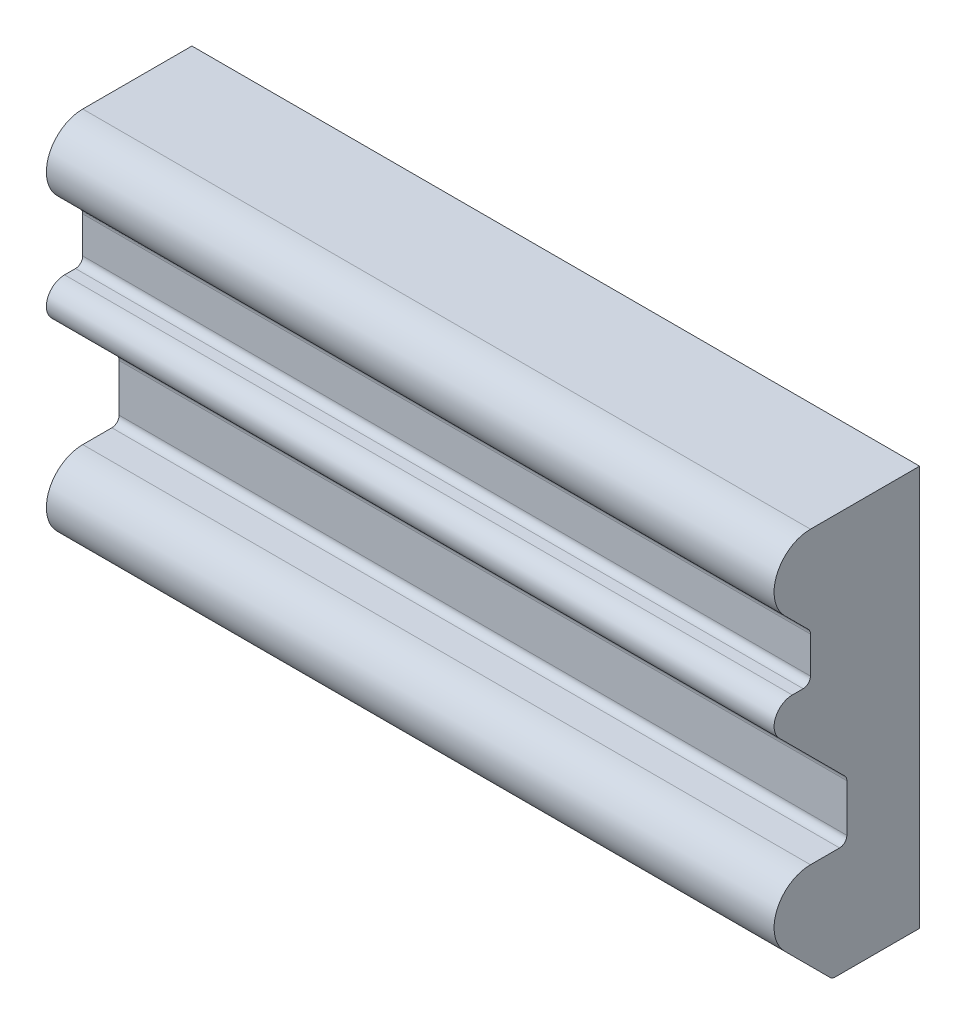
ISO-10303-21;
HEADER;
FILE_DESCRIPTION(('STEP AP214'),'2;1');
FILE_NAME('part.step','',(''),(''),'','','');
FILE_SCHEMA(('AUTOMOTIVE_DESIGN { 1 0 10303 214 1 1 1 1 }'));
ENDSEC;
DATA;
#1=APPLICATION_CONTEXT('core data for automotive mechanical design processes');
#2=APPLICATION_PROTOCOL_DEFINITION('international standard','automotive_design',2000,#1);
#3=PRODUCT_CONTEXT('',#1,'mechanical');
#4=PRODUCT('Part','Part','',(#3));
#5=PRODUCT_RELATED_PRODUCT_CATEGORY('part','',(#4));
#6=PRODUCT_DEFINITION_FORMATION('','',#4);
#7=PRODUCT_DEFINITION_CONTEXT('part definition',#1,'design');
#8=PRODUCT_DEFINITION('design','',#6,#7);
#9=PRODUCT_DEFINITION_SHAPE('','',#8);
#10=(LENGTH_UNIT() NAMED_UNIT(*) SI_UNIT(.MILLI.,.METRE.));
#11=(NAMED_UNIT(*) PLANE_ANGLE_UNIT() SI_UNIT($,.RADIAN.));
#12=(NAMED_UNIT(*) SI_UNIT($,.STERADIAN.) SOLID_ANGLE_UNIT());
#13=UNCERTAINTY_MEASURE_WITH_UNIT(LENGTH_MEASURE(1.E-05),#10,'distance_accuracy_value','');
#14=(GEOMETRIC_REPRESENTATION_CONTEXT(3) GLOBAL_UNCERTAINTY_ASSIGNED_CONTEXT((#13)) GLOBAL_UNIT_ASSIGNED_CONTEXT((#10,
#11,#12)) REPRESENTATION_CONTEXT('',''));
#15=CARTESIAN_POINT('',(0.,0.,0.));
#16=DIRECTION('',(0.,0.,1.));
#17=DIRECTION('',(1.,0.,0.));
#18=AXIS2_PLACEMENT_3D('',#15,#16,#17);
#19=CARTESIAN_POINT('',(200.,75.0294372515229,32.));
#20=DIRECTION('',(-1.,0.,0.));
#21=DIRECTION('',(0.,0.,1.));
#22=AXIS2_PLACEMENT_3D('',#19,#20,#21);
#23=CYLINDRICAL_SURFACE('',#22,2.);
#24=CARTESIAN_POINT('',(0.,75.0294372515229,32.));
#25=DIRECTION('',(-1.,0.,0.));
#26=DIRECTION('',(0.,0.,1.));
#27=AXIS2_PLACEMENT_3D('',#24,#25,#26);
#28=CIRCLE('',#27,2.);
#29=CARTESIAN_POINT('',(0.,75.0294372515229,30.));
#30=VERTEX_POINT('',#29);
#31=CARTESIAN_POINT('',(0.,73.0294372515229,32.));
#32=VERTEX_POINT('',#31);
#33=EDGE_CURVE('E188',#30,#32,#28,.T.);
#34=ORIENTED_EDGE('',*,*,#33,.T.);
#35=DIRECTION('',(-1.,0.,0.));
#36=VECTOR('',#35,1.);
#37=CARTESIAN_POINT('',(200.,73.0294372515229,32.));
#38=LINE('',#37,#36);
#39=CARTESIAN_POINT('',(200.,73.0294372515229,32.));
#40=VERTEX_POINT('',#39);
#41=EDGE_CURVE('E11',#40,#32,#38,.T.);
#42=ORIENTED_EDGE('',*,*,#41,.F.);
#43=CARTESIAN_POINT('',(200.,75.0294372515229,32.));
#44=DIRECTION('',(-1.,0.,0.));
#45=DIRECTION('',(0.,0.,1.));
#46=AXIS2_PLACEMENT_3D('',#43,#44,#45);
#47=CIRCLE('',#46,2.);
#48=CARTESIAN_POINT('',(200.,75.0294372515229,30.));
#49=VERTEX_POINT('',#48);
#50=EDGE_CURVE('E222',#49,#40,#47,.T.);
#51=ORIENTED_EDGE('',*,*,#50,.F.);
#52=DIRECTION('',(-1.,0.,0.));
#53=VECTOR('',#52,1.);
#54=CARTESIAN_POINT('',(200.,75.0294372515229,30.));
#55=LINE('',#54,#53);
#56=EDGE_CURVE('E184',#49,#30,#55,.T.);
#57=ORIENTED_EDGE('',*,*,#56,.T.);
#58=EDGE_LOOP('',(#34,#42,#51,#57));
#59=FACE_BOUND('',#58,.T.);
#60=ADVANCED_FACE('F32',(#59),#23,.F.);
#61=CARTESIAN_POINT('',(200.,73.0294372515229,35.));
#62=DIRECTION('',(0.,-1.,0.));
#63=DIRECTION('',(0.,0.,-1.));
#64=AXIS2_PLACEMENT_3D('',#61,#62,#63);
#65=PLANE('',#64);
#66=DIRECTION('',(0.,0.,1.));
#67=VECTOR('',#66,1.);
#68=CARTESIAN_POINT('',(0.,73.0294372515229,35.));
#69=LINE('',#68,#67);
#70=CARTESIAN_POINT('',(0.,73.0294372515229,35.));
#71=VERTEX_POINT('',#70);
#72=EDGE_CURVE('E191',#32,#71,#69,.T.);
#73=ORIENTED_EDGE('',*,*,#72,.T.);
#74=DIRECTION('',(-1.,0.,0.));
#75=VECTOR('',#74,1.);
#76=CARTESIAN_POINT('',(200.,73.0294372515229,35.));
#77=LINE('',#76,#75);
#78=CARTESIAN_POINT('',(200.,73.0294372515229,35.));
#79=VERTEX_POINT('',#78);
#80=EDGE_CURVE('E40',#79,#71,#77,.T.);
#81=ORIENTED_EDGE('',*,*,#80,.F.);
#82=DIRECTION('',(0.,0.,1.));
#83=VECTOR('',#82,1.);
#84=CARTESIAN_POINT('',(200.,73.0294372515229,35.));
#85=LINE('',#84,#83);
#86=EDGE_CURVE('E121',#40,#79,#85,.T.);
#87=ORIENTED_EDGE('',*,*,#86,.F.);
#88=ORIENTED_EDGE('',*,*,#41,.T.);
#89=EDGE_LOOP('',(#73,#81,#87,#88));
#90=FACE_BOUND('',#89,.T.);
#91=ADVANCED_FACE('F330',(#90),#65,.F.);
#92=CARTESIAN_POINT('',(200.,68.0294372515229,35.));
#93=DIRECTION('',(-1.,0.,0.));
#94=DIRECTION('',(0.,0.,1.));
#95=AXIS2_PLACEMENT_3D('',#92,#93,#94);
#96=CYLINDRICAL_SURFACE('',#95,5.);
#97=CARTESIAN_POINT('',(0.,68.0294372515229,35.));
#98=DIRECTION('',(1.,0.,0.));
#99=DIRECTION('',(0.,0.,-1.));
#100=AXIS2_PLACEMENT_3D('',#97,#98,#99);
#101=CIRCLE('',#100,5.);
#102=CARTESIAN_POINT('',(0.,64.4939033455902,38.5355339059328));
#103=VERTEX_POINT('',#102);
#104=EDGE_CURVE('E193',#71,#103,#101,.T.);
#105=ORIENTED_EDGE('',*,*,#104,.T.);
#106=DIRECTION('',(-1.,0.,0.));
#107=VECTOR('',#106,1.);
#108=CARTESIAN_POINT('',(200.,64.4939033455902,38.5355339059328));
#109=LINE('',#108,#107);
#110=CARTESIAN_POINT('',(200.,64.4939033455902,38.5355339059328));
#111=VERTEX_POINT('',#110);
#112=EDGE_CURVE('E259',#111,#103,#109,.T.);
#113=ORIENTED_EDGE('',*,*,#112,.F.);
#114=CARTESIAN_POINT('',(200.,68.0294372515229,35.));
#115=DIRECTION('',(1.,0.,0.));
#116=DIRECTION('',(0.,0.,-1.));
#117=AXIS2_PLACEMENT_3D('',#114,#115,#116);
#118=CIRCLE('',#117,5.);
#119=EDGE_CURVE('E267',#79,#111,#118,.T.);
#120=ORIENTED_EDGE('',*,*,#119,.F.);
#121=ORIENTED_EDGE('',*,*,#80,.T.);
#122=EDGE_LOOP('',(#105,#113,#120,#121));
#123=FACE_BOUND('',#122,.T.);
#124=ADVANCED_FACE('F265',(#123),#96,.T.);
#125=CARTESIAN_POINT('',(200.,64.4939033455902,38.5355339059328));
#126=DIRECTION('',(0.,0.707106781186544,-0.707106781186552));
#127=DIRECTION('',(0.,0.707106781186551,0.707106781186544));
#128=AXIS2_PLACEMENT_3D('',#125,#126,#127);
#129=PLANE('',#128);
#130=DIRECTION('',(0.,-0.707106781186551,-0.707106781186544));
#131=VECTOR('',#130,1.);
#132=CARTESIAN_POINT('',(0.,64.4939033455902,38.5355339059328));
#133=LINE('',#132,#131);
#134=CARTESIAN_POINT('',(0.,46.5441558772841,20.5857864376269));
#135=VERTEX_POINT('',#134);
#136=EDGE_CURVE('E195',#103,#135,#133,.T.);
#137=ORIENTED_EDGE('',*,*,#136,.T.);
#138=DIRECTION('',(-1.,0.,0.));
#139=VECTOR('',#138,1.);
#140=CARTESIAN_POINT('',(200.,46.5441558772841,20.5857864376269));
#141=LINE('',#140,#139);
#142=CARTESIAN_POINT('',(200.,46.5441558772841,20.5857864376269));
#143=VERTEX_POINT('',#142);
#144=EDGE_CURVE('E256',#143,#135,#141,.T.);
#145=ORIENTED_EDGE('',*,*,#144,.F.);
#146=DIRECTION('',(0.,-0.707106781186551,-0.707106781186544));
#147=VECTOR('',#146,1.);
#148=CARTESIAN_POINT('',(200.,64.4939033455902,38.5355339059328));
#149=LINE('',#148,#147);
#150=EDGE_CURVE('E285',#111,#143,#149,.T.);
#151=ORIENTED_EDGE('',*,*,#150,.F.);
#152=ORIENTED_EDGE('',*,*,#112,.T.);
#153=EDGE_LOOP('',(#137,#145,#151,#152));
#154=FACE_BOUND('',#153,.T.);
#155=ADVANCED_FACE('F276',(#154),#129,.F.);
#156=CARTESIAN_POINT('',(200.,45.129942314911,22.));
#157=DIRECTION('',(-1.,0.,0.));
#158=DIRECTION('',(0.,0.,1.));
#159=AXIS2_PLACEMENT_3D('',#156,#157,#158);
#160=CYLINDRICAL_SURFACE('',#159,1.99999999999999);
#161=CARTESIAN_POINT('',(0.,45.129942314911,22.));
#162=DIRECTION('',(-1.,0.,0.));
#163=DIRECTION('',(0.,0.,1.));
#164=AXIS2_PLACEMENT_3D('',#161,#162,#163);
#165=CIRCLE('',#164,1.99999999999999);
#166=CARTESIAN_POINT('',(0.,45.129942314911,20.));
#167=VERTEX_POINT('',#166);
#168=EDGE_CURVE('E197',#135,#167,#165,.T.);
#169=ORIENTED_EDGE('',*,*,#168,.T.);
#170=DIRECTION('',(-1.,0.,0.));
#171=VECTOR('',#170,1.);
#172=CARTESIAN_POINT('',(200.,45.129942314911,20.));
#173=LINE('',#172,#171);
#174=CARTESIAN_POINT('',(200.,45.129942314911,20.));
#175=VERTEX_POINT('',#174);
#176=EDGE_CURVE('E253',#175,#167,#173,.T.);
#177=ORIENTED_EDGE('',*,*,#176,.F.);
#178=CARTESIAN_POINT('',(200.,45.129942314911,22.));
#179=DIRECTION('',(-1.,0.,0.));
#180=DIRECTION('',(0.,0.,1.));
#181=AXIS2_PLACEMENT_3D('',#178,#179,#180);
#182=CIRCLE('',#181,1.99999999999999);
#183=EDGE_CURVE('E282',#143,#175,#182,.T.);
#184=ORIENTED_EDGE('',*,*,#183,.F.);
#185=ORIENTED_EDGE('',*,*,#144,.T.);
#186=EDGE_LOOP('',(#169,#177,#184,#185));
#187=FACE_BOUND('',#186,.T.);
#188=ADVANCED_FACE('F280',(#187),#160,.F.);
#189=CARTESIAN_POINT('',(200.,32.129942314911,20.));
#190=DIRECTION('',(0.,0.,-1.));
#191=DIRECTION('',(-1.,0.,0.));
#192=AXIS2_PLACEMENT_3D('',#189,#190,#191);
#193=PLANE('',#192);
#194=DIRECTION('',(0.,-1.,0.));
#195=VECTOR('',#194,1.);
#196=CARTESIAN_POINT('',(0.,32.129942314911,20.));
#197=LINE('',#196,#195);
#198=CARTESIAN_POINT('',(0.,32.129942314911,20.));
#199=VERTEX_POINT('',#198);
#200=EDGE_CURVE('E199',#167,#199,#197,.T.);
#201=ORIENTED_EDGE('',*,*,#200,.T.);
#202=DIRECTION('',(-1.,0.,0.));
#203=VECTOR('',#202,1.);
#204=CARTESIAN_POINT('',(200.,32.129942314911,20.));
#205=LINE('',#204,#203);
#206=CARTESIAN_POINT('',(200.,32.129942314911,20.));
#207=VERTEX_POINT('',#206);
#208=EDGE_CURVE('E250',#207,#199,#205,.T.);
#209=ORIENTED_EDGE('',*,*,#208,.F.);
#210=DIRECTION('',(0.,-1.,0.));
#211=VECTOR('',#210,1.);
#212=CARTESIAN_POINT('',(200.,32.129942314911,20.));
#213=LINE('',#212,#211);
#214=EDGE_CURVE('E284',#175,#207,#213,.T.);
#215=ORIENTED_EDGE('',*,*,#214,.F.);
#216=ORIENTED_EDGE('',*,*,#176,.T.);
#217=EDGE_LOOP('',(#201,#209,#215,#216));
#218=FACE_BOUND('',#217,.T.);
#219=ADVANCED_FACE('F343',(#218),#193,.F.);
#220=CARTESIAN_POINT('',(200.,32.129942314911,22.));
#221=DIRECTION('',(-1.,0.,0.));
#222=DIRECTION('',(0.,0.,1.));
#223=AXIS2_PLACEMENT_3D('',#220,#221,#222);
#224=CYLINDRICAL_SURFACE('',#223,2.);
#225=CARTESIAN_POINT('',(0.,32.129942314911,22.));
#226=DIRECTION('',(-1.,0.,0.));
#227=DIRECTION('',(0.,0.,1.));
#228=AXIS2_PLACEMENT_3D('',#225,#226,#227);
#229=CIRCLE('',#228,2.);
#230=CARTESIAN_POINT('',(0.,30.129942314911,22.));
#231=VERTEX_POINT('',#230);
#232=EDGE_CURVE('E201',#199,#231,#229,.T.);
#233=ORIENTED_EDGE('',*,*,#232,.T.);
#234=DIRECTION('',(-1.,0.,0.));
#235=VECTOR('',#234,1.);
#236=CARTESIAN_POINT('',(200.,30.129942314911,22.));
#237=LINE('',#236,#235);
#238=CARTESIAN_POINT('',(200.,30.129942314911,22.));
#239=VERTEX_POINT('',#238);
#240=EDGE_CURVE('E247',#239,#231,#237,.T.);
#241=ORIENTED_EDGE('',*,*,#240,.F.);
#242=CARTESIAN_POINT('',(200.,32.129942314911,22.));
#243=DIRECTION('',(-1.,0.,0.));
#244=DIRECTION('',(0.,0.,1.));
#245=AXIS2_PLACEMENT_3D('',#242,#243,#244);
#246=CIRCLE('',#245,2.);
#247=EDGE_CURVE('E287',#207,#239,#246,.T.);
#248=ORIENTED_EDGE('',*,*,#247,.F.);
#249=ORIENTED_EDGE('',*,*,#208,.T.);
#250=EDGE_LOOP('',(#233,#241,#248,#249));
#251=FACE_BOUND('',#250,.T.);
#252=ADVANCED_FACE('F346',(#251),#224,.F.);
#253=CARTESIAN_POINT('',(200.,30.129942314911,30.));
#254=DIRECTION('',(0.,-1.,0.));
#255=DIRECTION('',(0.,0.,-1.));
#256=AXIS2_PLACEMENT_3D('',#253,#254,#255);
#257=PLANE('',#256);
#258=DIRECTION('',(0.,0.,1.));
#259=VECTOR('',#258,1.);
#260=CARTESIAN_POINT('',(0.,30.129942314911,30.));
#261=LINE('',#260,#259);
#262=CARTESIAN_POINT('',(0.,30.129942314911,30.));
#263=VERTEX_POINT('',#262);
#264=EDGE_CURVE('E203',#231,#263,#261,.T.);
#265=ORIENTED_EDGE('',*,*,#264,.T.);
#266=DIRECTION('',(-1.,0.,0.));
#267=VECTOR('',#266,1.);
#268=CARTESIAN_POINT('',(200.,30.129942314911,30.));
#269=LINE('',#268,#267);
#270=CARTESIAN_POINT('',(200.,30.129942314911,30.));
#271=VERTEX_POINT('',#270);
#272=EDGE_CURVE('E244',#271,#263,#269,.T.);
#273=ORIENTED_EDGE('',*,*,#272,.F.);
#274=DIRECTION('',(0.,0.,1.));
#275=VECTOR('',#274,1.);
#276=CARTESIAN_POINT('',(200.,30.129942314911,30.));
#277=LINE('',#276,#275);
#278=EDGE_CURVE('E293',#239,#271,#277,.T.);
#279=ORIENTED_EDGE('',*,*,#278,.F.);
#280=ORIENTED_EDGE('',*,*,#240,.T.);
#281=EDGE_LOOP('',(#265,#273,#279,#280));
#282=FACE_BOUND('',#281,.T.);
#283=ADVANCED_FACE('F350',(#282),#257,.F.);
#284=CARTESIAN_POINT('',(200.,20.129942314911,30.));
#285=DIRECTION('',(-1.,0.,0.));
#286=DIRECTION('',(0.,0.,1.));
#287=AXIS2_PLACEMENT_3D('',#284,#285,#286);
#288=CYLINDRICAL_SURFACE('',#287,10.);
#289=CARTESIAN_POINT('',(0.,20.129942314911,30.));
#290=DIRECTION('',(1.,0.,0.));
#291=DIRECTION('',(0.,0.,-1.));
#292=AXIS2_PLACEMENT_3D('',#289,#290,#291);
#293=CIRCLE('',#292,10.);
#294=CARTESIAN_POINT('',(0.,13.0588745030455,37.0710678118654));
#295=VERTEX_POINT('',#294);
#296=EDGE_CURVE('E205',#263,#295,#293,.T.);
#297=ORIENTED_EDGE('',*,*,#296,.T.);
#298=DIRECTION('',(-1.,0.,0.));
#299=VECTOR('',#298,1.);
#300=CARTESIAN_POINT('',(200.,13.0588745030455,37.0710678118654));
#301=LINE('',#300,#299);
#302=CARTESIAN_POINT('',(200.,13.0588745030455,37.0710678118654));
#303=VERTEX_POINT('',#302);
#304=EDGE_CURVE('E241',#303,#295,#301,.T.);
#305=ORIENTED_EDGE('',*,*,#304,.F.);
#306=CARTESIAN_POINT('',(200.,20.129942314911,30.));
#307=DIRECTION('',(1.,0.,0.));
#308=DIRECTION('',(0.,0.,-1.));
#309=AXIS2_PLACEMENT_3D('',#306,#307,#308);
#310=CIRCLE('',#309,10.);
#311=EDGE_CURVE('E295',#271,#303,#310,.T.);
#312=ORIENTED_EDGE('',*,*,#311,.F.);
#313=ORIENTED_EDGE('',*,*,#272,.T.);
#314=EDGE_LOOP('',(#297,#305,#312,#313));
#315=FACE_BOUND('',#314,.T.);
#316=ADVANCED_FACE('F354',(#315),#288,.T.);
#317=CARTESIAN_POINT('',(200.,13.0588745030455,37.0710678118654));
#318=DIRECTION('',(0.,0.707106781186549,-0.707106781186546));
#319=DIRECTION('',(0.,0.707106781186546,0.707106781186549));
#320=AXIS2_PLACEMENT_3D('',#317,#318,#319);
#321=PLANE('',#320);
#322=DIRECTION('',(0.,-0.707106781186546,-0.707106781186549));
#323=VECTOR('',#322,1.);
#324=CARTESIAN_POINT('',(0.,13.0588745030455,37.0710678118654));
#325=LINE('',#324,#323);
#326=CARTESIAN_POINT('',(0.,0.585786437626899,24.5979797464468));
#327=VERTEX_POINT('',#326);
#328=EDGE_CURVE('E207',#295,#327,#325,.T.);
#329=ORIENTED_EDGE('',*,*,#328,.T.);
#330=DIRECTION('',(-1.,0.,0.));
#331=VECTOR('',#330,1.);
#332=CARTESIAN_POINT('',(200.,0.585786437626899,24.5979797464468));
#333=LINE('',#332,#331);
#334=CARTESIAN_POINT('',(200.,0.585786437626899,24.5979797464468));
#335=VERTEX_POINT('',#334);
#336=EDGE_CURVE('E238',#335,#327,#333,.T.);
#337=ORIENTED_EDGE('',*,*,#336,.F.);
#338=DIRECTION('',(0.,-0.707106781186546,-0.707106781186549));
#339=VECTOR('',#338,1.);
#340=CARTESIAN_POINT('',(200.,13.0588745030455,37.0710678118654));
#341=LINE('',#340,#339);
#342=EDGE_CURVE('E297',#303,#335,#341,.T.);
#343=ORIENTED_EDGE('',*,*,#342,.F.);
#344=ORIENTED_EDGE('',*,*,#304,.T.);
#345=EDGE_LOOP('',(#329,#337,#343,#344));
#346=FACE_BOUND('',#345,.T.);
#347=ADVANCED_FACE('F358',(#346),#321,.F.);
#348=CARTESIAN_POINT('',(200.,2.,23.1837661840737));
#349=DIRECTION('',(-1.,0.,0.));
#350=DIRECTION('',(0.,0.,1.));
#351=AXIS2_PLACEMENT_3D('',#348,#349,#350);
#352=CYLINDRICAL_SURFACE('',#351,2.);
#353=CARTESIAN_POINT('',(0.,2.,23.1837661840737));
#354=DIRECTION('',(1.,0.,0.));
#355=DIRECTION('',(0.,0.,1.));
#356=AXIS2_PLACEMENT_3D('',#353,#354,#355);
#357=CIRCLE('',#356,2.);
#358=CARTESIAN_POINT('',(0.,0.,23.1837661840737));
#359=VERTEX_POINT('',#358);
#360=EDGE_CURVE('E209',#327,#359,#357,.T.);
#361=ORIENTED_EDGE('',*,*,#360,.T.);
#362=DIRECTION('',(-1.,0.,0.));
#363=VECTOR('',#362,1.);
#364=CARTESIAN_POINT('',(200.,0.,23.1837661840737));
#365=LINE('',#364,#363);
#366=CARTESIAN_POINT('',(200.,0.,23.1837661840737));
#367=VERTEX_POINT('',#366);
#368=EDGE_CURVE('E235',#367,#359,#365,.T.);
#369=ORIENTED_EDGE('',*,*,#368,.F.);
#370=CARTESIAN_POINT('',(200.,2.,23.1837661840737));
#371=DIRECTION('',(1.,0.,0.));
#372=DIRECTION('',(0.,0.,1.));
#373=AXIS2_PLACEMENT_3D('',#370,#371,#372);
#374=CIRCLE('',#373,2.);
#375=EDGE_CURVE('E299',#335,#367,#374,.T.);
#376=ORIENTED_EDGE('',*,*,#375,.F.);
#377=ORIENTED_EDGE('',*,*,#336,.T.);
#378=EDGE_LOOP('',(#361,#369,#376,#377));
#379=FACE_BOUND('',#378,.T.);
#380=ADVANCED_FACE('F362',(#379),#352,.T.);
#381=CARTESIAN_POINT('',(200.,0.,0.));
#382=DIRECTION('',(0.,1.,0.));
#383=DIRECTION('',(0.,0.,1.));
#384=AXIS2_PLACEMENT_3D('',#381,#382,#383);
#385=PLANE('',#384);
#386=DIRECTION('',(0.,0.,-1.));
#387=VECTOR('',#386,1.);
#388=CARTESIAN_POINT('',(0.,0.,0.));
#389=LINE('',#388,#387);
#390=CARTESIAN_POINT('',(0.,0.,0.));
#391=VERTEX_POINT('',#390);
#392=EDGE_CURVE('E211',#359,#391,#389,.T.);
#393=ORIENTED_EDGE('',*,*,#392,.T.);
#394=DIRECTION('',(-1.,0.,0.));
#395=VECTOR('',#394,1.);
#396=CARTESIAN_POINT('',(200.,0.,0.));
#397=LINE('',#396,#395);
#398=CARTESIAN_POINT('',(200.,0.,0.));
#399=VERTEX_POINT('',#398);
#400=EDGE_CURVE('E232',#399,#391,#397,.T.);
#401=ORIENTED_EDGE('',*,*,#400,.F.);
#402=DIRECTION('',(0.,0.,-1.));
#403=VECTOR('',#402,1.);
#404=CARTESIAN_POINT('',(200.,0.,0.));
#405=LINE('',#404,#403);
#406=EDGE_CURVE('E301',#367,#399,#405,.T.);
#407=ORIENTED_EDGE('',*,*,#406,.F.);
#408=ORIENTED_EDGE('',*,*,#368,.T.);
#409=EDGE_LOOP('',(#393,#401,#407,#408));
#410=FACE_BOUND('',#409,.T.);
#411=ADVANCED_FACE('F366',(#410),#385,.F.);
#412=CARTESIAN_POINT('',(200.,0.,0.));
#413=DIRECTION('',(0.,0.,1.));
#414=DIRECTION('',(1.,0.,0.));
#415=AXIS2_PLACEMENT_3D('',#412,#413,#414);
#416=PLANE('',#415);
#417=DIRECTION('',(0.,1.,0.));
#418=VECTOR('',#417,1.);
#419=CARTESIAN_POINT('',(0.,0.,0.));
#420=LINE('',#419,#418);
#421=CARTESIAN_POINT('',(0.,110.,0.));
#422=VERTEX_POINT('',#421);
#423=EDGE_CURVE('E213',#391,#422,#420,.T.);
#424=ORIENTED_EDGE('',*,*,#423,.T.);
#425=DIRECTION('',(-1.,0.,0.));
#426=VECTOR('',#425,1.);
#427=CARTESIAN_POINT('',(200.,110.,0.));
#428=LINE('',#427,#426);
#429=CARTESIAN_POINT('',(200.,110.,0.));
#430=VERTEX_POINT('',#429);
#431=EDGE_CURVE('E229',#430,#422,#428,.T.);
#432=ORIENTED_EDGE('',*,*,#431,.F.);
#433=DIRECTION('',(0.,1.,0.));
#434=VECTOR('',#433,1.);
#435=CARTESIAN_POINT('',(200.,0.,0.));
#436=LINE('',#435,#434);
#437=EDGE_CURVE('E303',#399,#430,#436,.T.);
#438=ORIENTED_EDGE('',*,*,#437,.F.);
#439=ORIENTED_EDGE('',*,*,#400,.T.);
#440=EDGE_LOOP('',(#424,#432,#438,#439));
#441=FACE_BOUND('',#440,.T.);
#442=ADVANCED_FACE('F370',(#441),#416,.F.);
#443=CARTESIAN_POINT('',(200.,110.,0.));
#444=DIRECTION('',(0.,-1.,0.));
#445=DIRECTION('',(0.,0.,-1.));
#446=AXIS2_PLACEMENT_3D('',#443,#444,#445);
#447=PLANE('',#446);
#448=DIRECTION('',(0.,0.,1.));
#449=VECTOR('',#448,1.);
#450=CARTESIAN_POINT('',(0.,110.,0.));
#451=LINE('',#450,#449);
#452=CARTESIAN_POINT('',(0.,110.,30.));
#453=VERTEX_POINT('',#452);
#454=EDGE_CURVE('E215',#422,#453,#451,.T.);
#455=ORIENTED_EDGE('',*,*,#454,.T.);
#456=DIRECTION('',(-1.,0.,0.));
#457=VECTOR('',#456,1.);
#458=CARTESIAN_POINT('',(200.,110.,30.));
#459=LINE('',#458,#457);
#460=CARTESIAN_POINT('',(200.,110.,30.));
#461=VERTEX_POINT('',#460);
#462=EDGE_CURVE('E226',#461,#453,#459,.T.);
#463=ORIENTED_EDGE('',*,*,#462,.F.);
#464=DIRECTION('',(0.,0.,1.));
#465=VECTOR('',#464,1.);
#466=CARTESIAN_POINT('',(200.,110.,0.));
#467=LINE('',#466,#465);
#468=EDGE_CURVE('E305',#430,#461,#467,.T.);
#469=ORIENTED_EDGE('',*,*,#468,.F.);
#470=ORIENTED_EDGE('',*,*,#431,.T.);
#471=EDGE_LOOP('',(#455,#463,#469,#470));
#472=FACE_BOUND('',#471,.T.);
#473=ADVANCED_FACE('F311',(#472),#447,.F.);
#474=CARTESIAN_POINT('',(200.,100.,30.));
#475=DIRECTION('',(-1.,0.,0.));
#476=DIRECTION('',(0.,0.,1.));
#477=AXIS2_PLACEMENT_3D('',#474,#475,#476);
#478=CYLINDRICAL_SURFACE('',#477,10.);
#479=CARTESIAN_POINT('',(0.,100.,30.));
#480=DIRECTION('',(1.,0.,0.));
#481=DIRECTION('',(0.,0.,-1.));
#482=AXIS2_PLACEMENT_3D('',#479,#480,#481);
#483=CIRCLE('',#482,10.);
#484=CARTESIAN_POINT('',(0.,92.9289321881345,37.0710678118655));
#485=VERTEX_POINT('',#484);
#486=EDGE_CURVE('E217',#453,#485,#483,.T.);
#487=ORIENTED_EDGE('',*,*,#486,.T.);
#488=DIRECTION('',(-1.,0.,0.));
#489=VECTOR('',#488,1.);
#490=CARTESIAN_POINT('',(200.,92.9289321881345,37.0710678118655));
#491=LINE('',#490,#489);
#492=CARTESIAN_POINT('',(200.,92.9289321881345,37.0710678118655));
#493=VERTEX_POINT('',#492);
#494=EDGE_CURVE('E179',#493,#485,#491,.T.);
#495=ORIENTED_EDGE('',*,*,#494,.F.);
#496=CARTESIAN_POINT('',(200.,100.,30.));
#497=DIRECTION('',(1.,0.,0.));
#498=DIRECTION('',(0.,0.,-1.));
#499=AXIS2_PLACEMENT_3D('',#496,#497,#498);
#500=CIRCLE('',#499,10.);
#501=EDGE_CURVE('E170',#461,#493,#500,.T.);
#502=ORIENTED_EDGE('',*,*,#501,.F.);
#503=ORIENTED_EDGE('',*,*,#462,.T.);
#504=EDGE_LOOP('',(#487,#495,#502,#503));
#505=FACE_BOUND('',#504,.T.);
#506=ADVANCED_FACE('F315',(#505),#478,.T.);
#507=CARTESIAN_POINT('',(200.,92.9289321881345,37.0710678118655));
#508=DIRECTION('',(0.,0.70710678118655,-0.707106781186545));
#509=DIRECTION('',(0.,0.707106781186545,0.70710678118655));
#510=AXIS2_PLACEMENT_3D('',#507,#508,#509);
#511=PLANE('',#510);
#512=DIRECTION('',(0.,-0.707106781186545,-0.70710678118655));
#513=VECTOR('',#512,1.);
#514=CARTESIAN_POINT('',(0.,92.9289321881345,37.0710678118655));
#515=LINE('',#514,#513);
#516=CARTESIAN_POINT('',(0.,86.443650813896,30.5857864376269));
#517=VERTEX_POINT('',#516);
#518=EDGE_CURVE('E178',#485,#517,#515,.T.);
#519=ORIENTED_EDGE('',*,*,#518,.T.);
#520=DIRECTION('',(-1.,0.,0.));
#521=VECTOR('',#520,1.);
#522=CARTESIAN_POINT('',(200.,86.443650813896,30.5857864376269));
#523=LINE('',#522,#521);
#524=CARTESIAN_POINT('',(200.,86.443650813896,30.5857864376269));
#525=VERTEX_POINT('',#524);
#526=EDGE_CURVE('E175',#525,#517,#523,.T.);
#527=ORIENTED_EDGE('',*,*,#526,.F.);
#528=DIRECTION('',(0.,-0.707106781186545,-0.70710678118655));
#529=VECTOR('',#528,1.);
#530=CARTESIAN_POINT('',(200.,92.9289321881345,37.0710678118655));
#531=LINE('',#530,#529);
#532=EDGE_CURVE('E164',#493,#525,#531,.T.);
#533=ORIENTED_EDGE('',*,*,#532,.F.);
#534=ORIENTED_EDGE('',*,*,#494,.T.);
#535=EDGE_LOOP('',(#519,#527,#533,#534));
#536=FACE_BOUND('',#535,.T.);
#537=ADVANCED_FACE('F176',(#536),#511,.F.);
#538=CARTESIAN_POINT('',(200.,85.0294372515229,32.));
#539=DIRECTION('',(-1.,0.,0.));
#540=DIRECTION('',(0.,0.,1.));
#541=AXIS2_PLACEMENT_3D('',#538,#539,#540);
#542=CYLINDRICAL_SURFACE('',#541,2.00000000000001);
#543=CARTESIAN_POINT('',(0.,85.0294372515229,32.));
#544=DIRECTION('',(-1.,0.,0.));
#545=DIRECTION('',(0.,0.,1.));
#546=AXIS2_PLACEMENT_3D('',#543,#544,#545);
#547=CIRCLE('',#546,2.00000000000001);
#548=CARTESIAN_POINT('',(0.,85.0294372515229,30.));
#549=VERTEX_POINT('',#548);
#550=EDGE_CURVE('E107',#517,#549,#547,.T.);
#551=ORIENTED_EDGE('',*,*,#550,.T.);
#552=DIRECTION('',(-1.,0.,0.));
#553=VECTOR('',#552,1.);
#554=CARTESIAN_POINT('',(200.,85.0294372515229,30.));
#555=LINE('',#554,#553);
#556=CARTESIAN_POINT('',(200.,85.0294372515229,30.));
#557=VERTEX_POINT('',#556);
#558=EDGE_CURVE('E180',#557,#549,#555,.T.);
#559=ORIENTED_EDGE('',*,*,#558,.F.);
#560=CARTESIAN_POINT('',(200.,85.0294372515229,32.));
#561=DIRECTION('',(-1.,0.,0.));
#562=DIRECTION('',(0.,0.,1.));
#563=AXIS2_PLACEMENT_3D('',#560,#561,#562);
#564=CIRCLE('',#563,2.00000000000001);
#565=EDGE_CURVE('E168',#525,#557,#564,.T.);
#566=ORIENTED_EDGE('',*,*,#565,.F.);
#567=ORIENTED_EDGE('',*,*,#526,.T.);
#568=EDGE_LOOP('',(#551,#559,#566,#567));
#569=FACE_BOUND('',#568,.T.);
#570=ADVANCED_FACE('F182',(#569),#542,.F.);
#571=CARTESIAN_POINT('',(200.,85.0294372515229,30.));
#572=DIRECTION('',(0.,0.,-1.));
#573=DIRECTION('',(0.,1.,0.));
#574=AXIS2_PLACEMENT_3D('',#571,#572,#573);
#575=PLANE('',#574);
#576=DIRECTION('',(0.,-1.,0.));
#577=VECTOR('',#576,1.);
#578=CARTESIAN_POINT('',(0.,85.0294372515229,30.));
#579=LINE('',#578,#577);
#580=EDGE_CURVE('E113',#549,#30,#579,.T.);
#581=ORIENTED_EDGE('',*,*,#580,.T.);
#582=ORIENTED_EDGE('',*,*,#56,.F.);
#583=DIRECTION('',(0.,-1.,0.));
#584=VECTOR('',#583,1.);
#585=CARTESIAN_POINT('',(200.,85.0294372515229,30.));
#586=LINE('',#585,#584);
#587=EDGE_CURVE('E48',#557,#49,#586,.T.);
#588=ORIENTED_EDGE('',*,*,#587,.F.);
#589=ORIENTED_EDGE('',*,*,#558,.T.);
#590=EDGE_LOOP('',(#581,#582,#588,#589));
#591=FACE_BOUND('',#590,.T.);
#592=ADVANCED_FACE('F319',(#591),#575,.F.);
#593=CARTESIAN_POINT('',(200.,75.0294372515229,32.));
#594=DIRECTION('',(-1.,0.,0.));
#595=DIRECTION('',(0.,0.,1.));
#596=AXIS2_PLACEMENT_3D('',#593,#594,#595);
#597=PLANE('',#596);
#598=ORIENTED_EDGE('',*,*,#50,.T.);
#599=ORIENTED_EDGE('',*,*,#86,.T.);
#600=ORIENTED_EDGE('',*,*,#119,.T.);
#601=ORIENTED_EDGE('',*,*,#150,.T.);
#602=ORIENTED_EDGE('',*,*,#183,.T.);
#603=ORIENTED_EDGE('',*,*,#214,.T.);
#604=ORIENTED_EDGE('',*,*,#247,.T.);
#605=ORIENTED_EDGE('',*,*,#278,.T.);
#606=ORIENTED_EDGE('',*,*,#311,.T.);
#607=ORIENTED_EDGE('',*,*,#342,.T.);
#608=ORIENTED_EDGE('',*,*,#375,.T.);
#609=ORIENTED_EDGE('',*,*,#406,.T.);
#610=ORIENTED_EDGE('',*,*,#437,.T.);
#611=ORIENTED_EDGE('',*,*,#468,.T.);
#612=ORIENTED_EDGE('',*,*,#501,.T.);
#613=ORIENTED_EDGE('',*,*,#532,.T.);
#614=ORIENTED_EDGE('',*,*,#565,.T.);
#615=ORIENTED_EDGE('',*,*,#587,.T.);
#616=EDGE_LOOP('',(#598,#599,#600,#601,#602,#603,#604,#605,#606,#607,#608,#609,#610,#611,#612,
#613,#614,#615));
#617=FACE_BOUND('',#616,.T.);
#618=ADVANCED_FACE('F166',(#617),#597,.F.);
#619=CARTESIAN_POINT('',(0.,75.0294372515229,32.));
#620=DIRECTION('',(-1.,0.,0.));
#621=DIRECTION('',(0.,0.,1.));
#622=AXIS2_PLACEMENT_3D('',#619,#620,#621);
#623=PLANE('',#622);
#624=ORIENTED_EDGE('',*,*,#33,.F.);
#625=ORIENTED_EDGE('',*,*,#580,.F.);
#626=ORIENTED_EDGE('',*,*,#550,.F.);
#627=ORIENTED_EDGE('',*,*,#518,.F.);
#628=ORIENTED_EDGE('',*,*,#486,.F.);
#629=ORIENTED_EDGE('',*,*,#454,.F.);
#630=ORIENTED_EDGE('',*,*,#423,.F.);
#631=ORIENTED_EDGE('',*,*,#392,.F.);
#632=ORIENTED_EDGE('',*,*,#360,.F.);
#633=ORIENTED_EDGE('',*,*,#328,.F.);
#634=ORIENTED_EDGE('',*,*,#296,.F.);
#635=ORIENTED_EDGE('',*,*,#264,.F.);
#636=ORIENTED_EDGE('',*,*,#232,.F.);
#637=ORIENTED_EDGE('',*,*,#200,.F.);
#638=ORIENTED_EDGE('',*,*,#168,.F.);
#639=ORIENTED_EDGE('',*,*,#136,.F.);
#640=ORIENTED_EDGE('',*,*,#104,.F.);
#641=ORIENTED_EDGE('',*,*,#72,.F.);
#642=EDGE_LOOP('',(#624,#625,#626,#627,#628,#629,#630,#631,#632,#633,#634,#635,#636,#637,#638,
#639,#640,#641));
#643=FACE_BOUND('',#642,.T.);
#644=ADVANCED_FACE('F271',(#643),#623,.T.);
#645=CLOSED_SHELL('',(#60,#91,#124,#155,#188,#219,#252,#283,#316,#347,#380,#411,#442,#473,#506,
#537,#570,#592,#618,#644));
#646=MANIFOLD_SOLID_BREP('B2',#645);
#647=ADVANCED_BREP_SHAPE_REPRESENTATION('',(#18,#646),#14);
#648=SHAPE_DEFINITION_REPRESENTATION(#9,#647);
ENDSEC;
END-ISO-10303-21;
